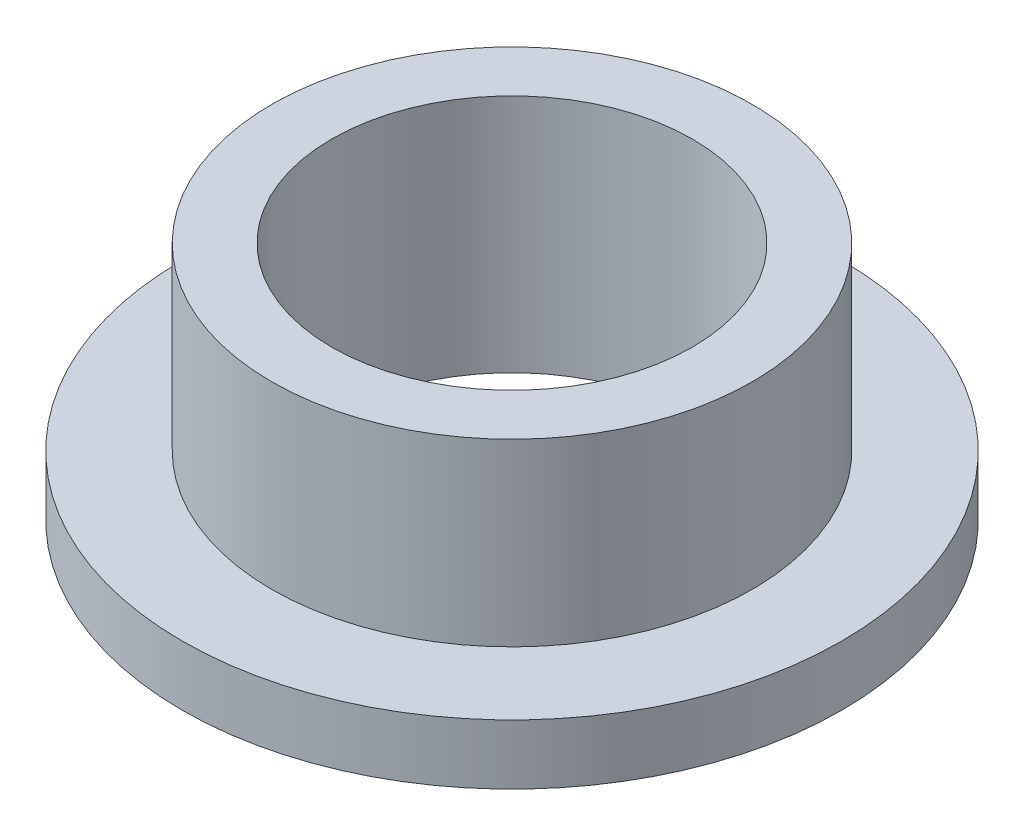
ISO-10303-21;
HEADER;
FILE_DESCRIPTION(('STEP AP214'),'2;1');
FILE_NAME('part.step','',(''),(''),'','','');
FILE_SCHEMA(('AUTOMOTIVE_DESIGN { 1 0 10303 214 1 1 1 1 }'));
ENDSEC;
DATA;
#1=APPLICATION_CONTEXT('core data for automotive mechanical design processes');
#2=APPLICATION_PROTOCOL_DEFINITION('international standard','automotive_design',2000,#1);
#3=PRODUCT_CONTEXT('',#1,'mechanical');
#4=PRODUCT('Part','Part','',(#3));
#5=PRODUCT_RELATED_PRODUCT_CATEGORY('part','',(#4));
#6=PRODUCT_DEFINITION_FORMATION('','',#4);
#7=PRODUCT_DEFINITION_CONTEXT('part definition',#1,'design');
#8=PRODUCT_DEFINITION('design','',#6,#7);
#9=PRODUCT_DEFINITION_SHAPE('','',#8);
#10=(LENGTH_UNIT() NAMED_UNIT(*) SI_UNIT(.MILLI.,.METRE.));
#11=(NAMED_UNIT(*) PLANE_ANGLE_UNIT() SI_UNIT($,.RADIAN.));
#12=(NAMED_UNIT(*) SI_UNIT($,.STERADIAN.) SOLID_ANGLE_UNIT());
#13=UNCERTAINTY_MEASURE_WITH_UNIT(LENGTH_MEASURE(1.E-05),#10,'distance_accuracy_value','');
#14=(GEOMETRIC_REPRESENTATION_CONTEXT(3) GLOBAL_UNCERTAINTY_ASSIGNED_CONTEXT((#13)) GLOBAL_UNIT_ASSIGNED_CONTEXT((#10,
#11,#12)) REPRESENTATION_CONTEXT('',''));
#15=CARTESIAN_POINT('',(0.,0.,0.));
#16=DIRECTION('',(0.,0.,1.));
#17=DIRECTION('',(1.,0.,0.));
#18=AXIS2_PLACEMENT_3D('',#15,#16,#17);
#19=CARTESIAN_POINT('',(0.,6.35,0.));
#20=DIRECTION('',(0.,1.,0.));
#21=DIRECTION('',(0.,0.,1.));
#22=AXIS2_PLACEMENT_3D('',#19,#20,#21);
#23=PLANE('',#22);
#24=CARTESIAN_POINT('',(0.,6.35,0.));
#25=DIRECTION('',(0.,1.,0.));
#26=DIRECTION('',(0.,0.,1.));
#27=AXIS2_PLACEMENT_3D('',#24,#25,#26);
#28=CIRCLE('',#27,6.3627);
#29=CARTESIAN_POINT('',(0.,6.35,6.3627));
#30=VERTEX_POINT('',#29);
#31=EDGE_CURVE('E10',#30,#30,#28,.T.);
#32=ORIENTED_EDGE('',*,*,#31,.T.);
#33=EDGE_LOOP('',(#32));
#34=FACE_BOUND('',#33,.T.);
#35=CARTESIAN_POINT('',(0.,6.35,0.));
#36=DIRECTION('',(0.,1.,0.));
#37=DIRECTION('',(0.,0.,1.));
#38=AXIS2_PLACEMENT_3D('',#35,#36,#37);
#39=CIRCLE('',#38,4.7752);
#40=CARTESIAN_POINT('',(0.,6.35,4.7752));
#41=VERTEX_POINT('',#40);
#42=EDGE_CURVE('E39',#41,#41,#39,.T.);
#43=ORIENTED_EDGE('',*,*,#42,.F.);
#44=EDGE_LOOP('',(#43));
#45=FACE_BOUND('',#44,.T.);
#46=ADVANCED_FACE('F32',(#34,#45),#23,.T.);
#47=CARTESIAN_POINT('',(0.,0.,0.));
#48=DIRECTION('',(0.,1.,0.));
#49=DIRECTION('',(0.,0.,1.));
#50=AXIS2_PLACEMENT_3D('',#47,#48,#49);
#51=PLANE('',#50);
#52=CARTESIAN_POINT('',(0.,0.,0.));
#53=DIRECTION('',(0.,1.,0.));
#54=DIRECTION('',(0.,0.,1.));
#55=AXIS2_PLACEMENT_3D('',#52,#53,#54);
#56=CIRCLE('',#55,4.7752);
#57=CARTESIAN_POINT('',(0.,0.,4.7752));
#58=VERTEX_POINT('',#57);
#59=EDGE_CURVE('E43',#58,#58,#56,.T.);
#60=ORIENTED_EDGE('',*,*,#59,.T.);
#61=EDGE_LOOP('',(#60));
#62=FACE_BOUND('',#61,.T.);
#63=CARTESIAN_POINT('',(0.,0.,0.));
#64=DIRECTION('',(0.,1.,0.));
#65=DIRECTION('',(0.,0.,1.));
#66=AXIS2_PLACEMENT_3D('',#63,#64,#65);
#67=CIRCLE('',#66,8.73125);
#68=CARTESIAN_POINT('',(0.,0.,8.73125));
#69=VERTEX_POINT('',#68);
#70=EDGE_CURVE('E50',#69,#69,#67,.T.);
#71=ORIENTED_EDGE('',*,*,#70,.F.);
#72=EDGE_LOOP('',(#71));
#73=FACE_BOUND('',#72,.T.);
#74=ADVANCED_FACE('F75',(#62,#73),#51,.F.);
#75=CARTESIAN_POINT('',(0.,6.35,0.));
#76=DIRECTION('',(0.,-1.,0.));
#77=DIRECTION('',(0.,0.,-1.));
#78=AXIS2_PLACEMENT_3D('',#75,#76,#77);
#79=CYLINDRICAL_SURFACE('',#78,6.3627);
#80=CARTESIAN_POINT('',(0.,1.5875,0.));
#81=DIRECTION('',(0.,1.,0.));
#82=DIRECTION('',(0.,0.,1.));
#83=AXIS2_PLACEMENT_3D('',#80,#81,#82);
#84=CIRCLE('',#83,6.3627);
#85=CARTESIAN_POINT('',(0.,1.5875,6.3627));
#86=VERTEX_POINT('',#85);
#87=EDGE_CURVE('E53',#86,#86,#84,.T.);
#88=ORIENTED_EDGE('',*,*,#87,.T.);
#89=EDGE_LOOP('',(#88));
#90=FACE_BOUND('',#89,.T.);
#91=ORIENTED_EDGE('',*,*,#31,.F.);
#92=EDGE_LOOP('',(#91));
#93=FACE_BOUND('',#92,.T.);
#94=ADVANCED_FACE('F34',(#90,#93),#79,.T.);
#95=CARTESIAN_POINT('',(0.,6.35,0.));
#96=DIRECTION('',(0.,-1.,0.));
#97=DIRECTION('',(0.,0.,-1.));
#98=AXIS2_PLACEMENT_3D('',#95,#96,#97);
#99=CYLINDRICAL_SURFACE('',#98,4.7752);
#100=ORIENTED_EDGE('',*,*,#42,.T.);
#101=EDGE_LOOP('',(#100));
#102=FACE_BOUND('',#101,.T.);
#103=ORIENTED_EDGE('',*,*,#59,.F.);
#104=EDGE_LOOP('',(#103));
#105=FACE_BOUND('',#104,.T.);
#106=ADVANCED_FACE('F64',(#102,#105),#99,.F.);
#107=CARTESIAN_POINT('',(0.,1.5875,0.));
#108=DIRECTION('',(0.,1.,0.));
#109=DIRECTION('',(0.,0.,1.));
#110=AXIS2_PLACEMENT_3D('',#107,#108,#109);
#111=PLANE('',#110);
#112=CARTESIAN_POINT('',(0.,1.5875,0.));
#113=DIRECTION('',(0.,1.,0.));
#114=DIRECTION('',(0.,0.,1.));
#115=AXIS2_PLACEMENT_3D('',#112,#113,#114);
#116=CIRCLE('',#115,8.73125);
#117=CARTESIAN_POINT('',(0.,1.5875,8.73125));
#118=VERTEX_POINT('',#117);
#119=EDGE_CURVE('E48',#118,#118,#116,.T.);
#120=ORIENTED_EDGE('',*,*,#119,.T.);
#121=EDGE_LOOP('',(#120));
#122=FACE_BOUND('',#121,.T.);
#123=ORIENTED_EDGE('',*,*,#87,.F.);
#124=EDGE_LOOP('',(#123));
#125=FACE_BOUND('',#124,.T.);
#126=ADVANCED_FACE('F61',(#122,#125),#111,.T.);
#127=CARTESIAN_POINT('',(0.,1.5875,0.));
#128=DIRECTION('',(0.,-1.,0.));
#129=DIRECTION('',(0.,0.,-1.));
#130=AXIS2_PLACEMENT_3D('',#127,#128,#129);
#131=CYLINDRICAL_SURFACE('',#130,8.73125);
#132=ORIENTED_EDGE('',*,*,#119,.F.);
#133=EDGE_LOOP('',(#132));
#134=FACE_BOUND('',#133,.T.);
#135=ORIENTED_EDGE('',*,*,#70,.T.);
#136=EDGE_LOOP('',(#135));
#137=FACE_BOUND('',#136,.T.);
#138=ADVANCED_FACE('F63',(#134,#137),#131,.T.);
#139=CLOSED_SHELL('',(#46,#74,#94,#106,#126,#138));
#140=MANIFOLD_SOLID_BREP('B2',#139);
#141=ADVANCED_BREP_SHAPE_REPRESENTATION('',(#18,#140),#14);
#142=SHAPE_DEFINITION_REPRESENTATION(#9,#141);
ENDSEC;
END-ISO-10303-21;
